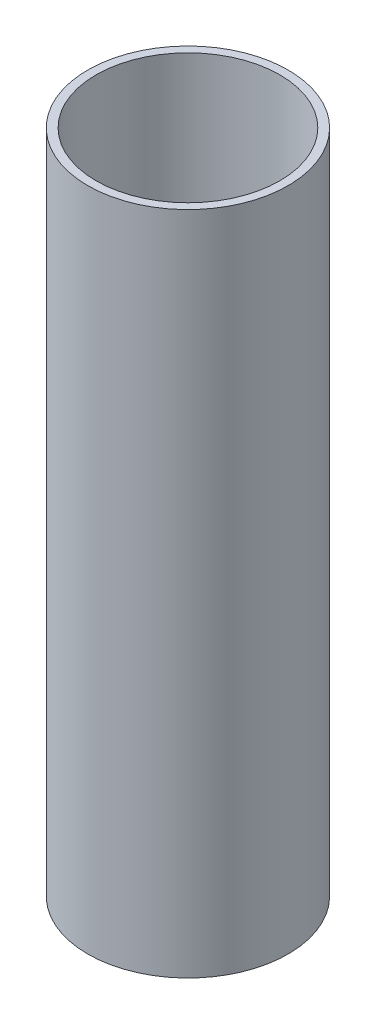
ISO-10303-21;
HEADER;
FILE_DESCRIPTION(('STEP AP214'),'2;1');
FILE_NAME('part.step','',(''),(''),'','','');
FILE_SCHEMA(('AUTOMOTIVE_DESIGN { 1 0 10303 214 1 1 1 1 }'));
ENDSEC;
DATA;
#1=APPLICATION_CONTEXT('core data for automotive mechanical design processes');
#2=APPLICATION_PROTOCOL_DEFINITION('international standard','automotive_design',2000,#1);
#3=PRODUCT_CONTEXT('',#1,'mechanical');
#4=PRODUCT('Part','Part','',(#3));
#5=PRODUCT_RELATED_PRODUCT_CATEGORY('part','',(#4));
#6=PRODUCT_DEFINITION_FORMATION('','',#4);
#7=PRODUCT_DEFINITION_CONTEXT('part definition',#1,'design');
#8=PRODUCT_DEFINITION('design','',#6,#7);
#9=PRODUCT_DEFINITION_SHAPE('','',#8);
#10=(LENGTH_UNIT() NAMED_UNIT(*) SI_UNIT(.MILLI.,.METRE.));
#11=(NAMED_UNIT(*) PLANE_ANGLE_UNIT() SI_UNIT($,.RADIAN.));
#12=(NAMED_UNIT(*) SI_UNIT($,.STERADIAN.) SOLID_ANGLE_UNIT());
#13=UNCERTAINTY_MEASURE_WITH_UNIT(LENGTH_MEASURE(1.E-05),#10,'distance_accuracy_value','');
#14=(GEOMETRIC_REPRESENTATION_CONTEXT(3) GLOBAL_UNCERTAINTY_ASSIGNED_CONTEXT((#13)) GLOBAL_UNIT_ASSIGNED_CONTEXT((#10,
#11,#12)) REPRESENTATION_CONTEXT('',''));
#15=CARTESIAN_POINT('',(0.,0.,0.));
#16=DIRECTION('',(0.,0.,1.));
#17=DIRECTION('',(1.,0.,0.));
#18=AXIS2_PLACEMENT_3D('',#15,#16,#17);
#19=CARTESIAN_POINT('',(0.,253.060427304222,0.));
#20=DIRECTION('',(0.,1.,0.));
#21=DIRECTION('',(0.,0.,1.));
#22=AXIS2_PLACEMENT_3D('',#19,#20,#21);
#23=PLANE('',#22);
#24=CARTESIAN_POINT('',(0.,253.060427304222,0.));
#25=DIRECTION('',(0.,1.,0.));
#26=DIRECTION('',(0.,0.,1.));
#27=AXIS2_PLACEMENT_3D('',#24,#25,#26);
#28=CIRCLE('',#27,38.1);
#29=CARTESIAN_POINT('',(0.,253.060427304222,38.1));
#30=VERTEX_POINT('',#29);
#31=EDGE_CURVE('E10',#30,#30,#28,.T.);
#32=ORIENTED_EDGE('',*,*,#31,.T.);
#33=EDGE_LOOP('',(#32));
#34=FACE_BOUND('',#33,.T.);
#35=CARTESIAN_POINT('',(0.,253.060427304222,0.));
#36=DIRECTION('',(0.,1.,0.));
#37=DIRECTION('',(0.,0.,1.));
#38=AXIS2_PLACEMENT_3D('',#35,#36,#37);
#39=CIRCLE('',#38,34.925);
#40=CARTESIAN_POINT('',(0.,253.060427304222,34.925));
#41=VERTEX_POINT('',#40);
#42=EDGE_CURVE('E49',#41,#41,#39,.T.);
#43=ORIENTED_EDGE('',*,*,#42,.F.);
#44=EDGE_LOOP('',(#43));
#45=FACE_BOUND('',#44,.T.);
#46=ADVANCED_FACE('F36',(#34,#45),#23,.T.);
#47=CARTESIAN_POINT('',(0.,0.,0.));
#48=DIRECTION('',(0.,1.,0.));
#49=DIRECTION('',(0.,0.,1.));
#50=AXIS2_PLACEMENT_3D('',#47,#48,#49);
#51=PLANE('',#50);
#52=CARTESIAN_POINT('',(0.,0.,0.));
#53=DIRECTION('',(0.,1.,0.));
#54=DIRECTION('',(0.,0.,1.));
#55=AXIS2_PLACEMENT_3D('',#52,#53,#54);
#56=CIRCLE('',#55,38.1);
#57=CARTESIAN_POINT('',(0.,0.,38.1));
#58=VERTEX_POINT('',#57);
#59=EDGE_CURVE('E40',#58,#58,#56,.T.);
#60=ORIENTED_EDGE('',*,*,#59,.F.);
#61=EDGE_LOOP('',(#60));
#62=FACE_BOUND('',#61,.T.);
#63=CARTESIAN_POINT('',(0.,0.,0.));
#64=DIRECTION('',(0.,1.,0.));
#65=DIRECTION('',(0.,0.,1.));
#66=AXIS2_PLACEMENT_3D('',#63,#64,#65);
#67=CIRCLE('',#66,34.925);
#68=CARTESIAN_POINT('',(0.,0.,34.925));
#69=VERTEX_POINT('',#68);
#70=EDGE_CURVE('E51',#69,#69,#67,.T.);
#71=ORIENTED_EDGE('',*,*,#70,.T.);
#72=EDGE_LOOP('',(#71));
#73=FACE_BOUND('',#72,.T.);
#74=ADVANCED_FACE('F63',(#62,#73),#51,.F.);
#75=CARTESIAN_POINT('',(0.,253.060427304222,0.));
#76=DIRECTION('',(0.,-1.,0.));
#77=DIRECTION('',(0.,0.,-1.));
#78=AXIS2_PLACEMENT_3D('',#75,#76,#77);
#79=CYLINDRICAL_SURFACE('',#78,38.1);
#80=ORIENTED_EDGE('',*,*,#31,.F.);
#81=EDGE_LOOP('',(#80));
#82=FACE_BOUND('',#81,.T.);
#83=ORIENTED_EDGE('',*,*,#59,.T.);
#84=EDGE_LOOP('',(#83));
#85=FACE_BOUND('',#84,.T.);
#86=ADVANCED_FACE('F38',(#82,#85),#79,.T.);
#87=CARTESIAN_POINT('',(0.,253.060427304222,0.));
#88=DIRECTION('',(0.,-1.,0.));
#89=DIRECTION('',(0.,0.,-1.));
#90=AXIS2_PLACEMENT_3D('',#87,#88,#89);
#91=CYLINDRICAL_SURFACE('',#90,34.925);
#92=ORIENTED_EDGE('',*,*,#42,.T.);
#93=EDGE_LOOP('',(#92));
#94=FACE_BOUND('',#93,.T.);
#95=ORIENTED_EDGE('',*,*,#70,.F.);
#96=EDGE_LOOP('',(#95));
#97=FACE_BOUND('',#96,.T.);
#98=ADVANCED_FACE('F59',(#94,#97),#91,.F.);
#99=CLOSED_SHELL('',(#46,#74,#86,#98));
#100=MANIFOLD_SOLID_BREP('B2',#99);
#101=ADVANCED_BREP_SHAPE_REPRESENTATION('',(#18,#100),#14);
#102=SHAPE_DEFINITION_REPRESENTATION(#9,#101);
ENDSEC;
END-ISO-10303-21;
